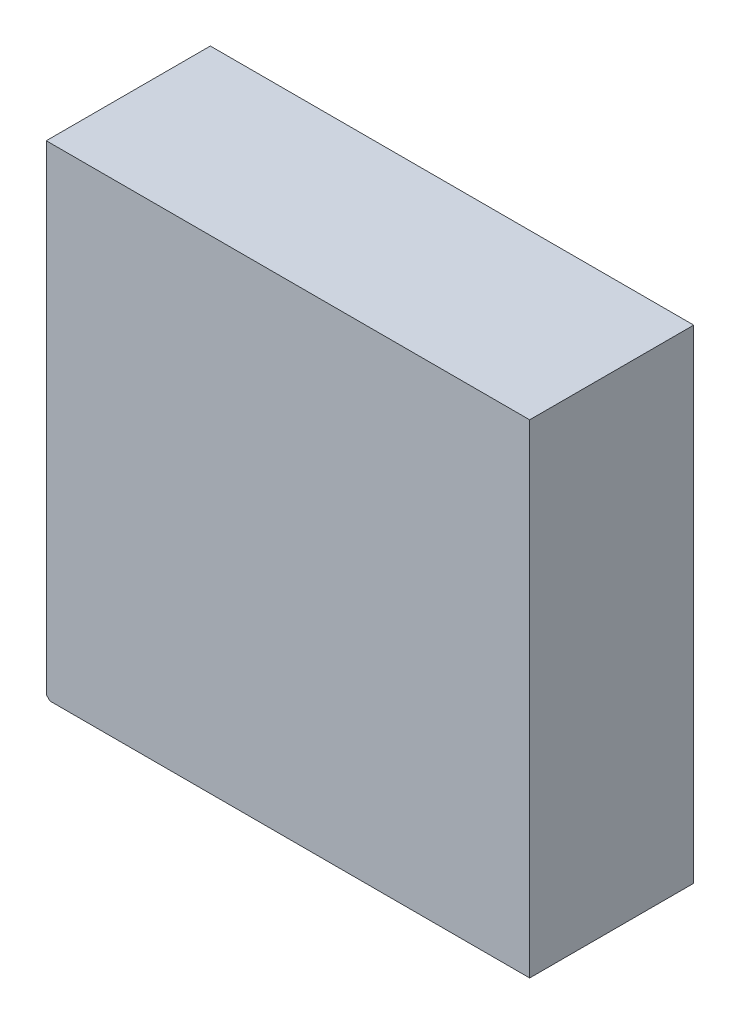
ISO-10303-21;
HEADER;
FILE_DESCRIPTION(('STEP AP214'),'2;1');
FILE_NAME('part.step','',(''),(''),'','','');
FILE_SCHEMA(('AUTOMOTIVE_DESIGN { 1 0 10303 214 1 1 1 1 }'));
ENDSEC;
DATA;
#1=APPLICATION_CONTEXT('core data for automotive mechanical design processes');
#2=APPLICATION_PROTOCOL_DEFINITION('international standard','automotive_design',2000,#1);
#3=PRODUCT_CONTEXT('',#1,'mechanical');
#4=PRODUCT('Part','Part','',(#3));
#5=PRODUCT_RELATED_PRODUCT_CATEGORY('part','',(#4));
#6=PRODUCT_DEFINITION_FORMATION('','',#4);
#7=PRODUCT_DEFINITION_CONTEXT('part definition',#1,'design');
#8=PRODUCT_DEFINITION('design','',#6,#7);
#9=PRODUCT_DEFINITION_SHAPE('','',#8);
#10=(LENGTH_UNIT() NAMED_UNIT(*) SI_UNIT(.MILLI.,.METRE.));
#11=(NAMED_UNIT(*) PLANE_ANGLE_UNIT() SI_UNIT($,.RADIAN.));
#12=(NAMED_UNIT(*) SI_UNIT($,.STERADIAN.) SOLID_ANGLE_UNIT());
#13=UNCERTAINTY_MEASURE_WITH_UNIT(LENGTH_MEASURE(1.E-05),#10,'distance_accuracy_value','');
#14=(GEOMETRIC_REPRESENTATION_CONTEXT(3) GLOBAL_UNCERTAINTY_ASSIGNED_CONTEXT((#13)) GLOBAL_UNIT_ASSIGNED_CONTEXT((#10,
#11,#12)) REPRESENTATION_CONTEXT('',''));
#15=CARTESIAN_POINT('',(0.,0.,0.));
#16=DIRECTION('',(0.,0.,1.));
#17=DIRECTION('',(1.,0.,0.));
#18=AXIS2_PLACEMENT_3D('',#15,#16,#17);
#19=CARTESIAN_POINT('',(1.64999924,-1.64999924,1.1200003));
#20=DIRECTION('',(0.,0.,-1.));
#21=DIRECTION('',(-1.,0.,0.));
#22=AXIS2_PLACEMENT_3D('',#19,#20,#21);
#23=PLANE('',#22);
#24=DIRECTION('',(1.,0.,0.));
#25=VECTOR('',#24,1.);
#26=CARTESIAN_POINT('',(1.64999924,1.64999924,1.1200003));
#27=LINE('',#26,#25);
#28=CARTESIAN_POINT('',(1.64999924,1.64999924,1.1200003));
#29=VERTEX_POINT('',#28);
#30=CARTESIAN_POINT('',(-1.64999924,1.64999924,1.1200003));
#31=VERTEX_POINT('',#30);
#32=EDGE_CURVE('E86',#29,#31,#27,.F.);
#33=ORIENTED_EDGE('',*,*,#32,.T.);
#34=DIRECTION('',(0.,1.,0.));
#35=VECTOR('',#34,1.);
#36=CARTESIAN_POINT('',(-1.64999924,1.64999924,1.1200003));
#37=LINE('',#36,#35);
#38=CARTESIAN_POINT('',(-1.64999924,-1.62500056,1.1200003));
#39=VERTEX_POINT('',#38);
#40=EDGE_CURVE('E62',#31,#39,#37,.F.);
#41=ORIENTED_EDGE('',*,*,#40,.T.);
#42=DIRECTION('',(-0.707106781186548,0.707106781186548,0.));
#43=VECTOR('',#42,1.);
#44=CARTESIAN_POINT('',(-1.64999924,-1.62500056,1.1200003));
#45=LINE('',#44,#43);
#46=CARTESIAN_POINT('',(-1.62500056,-1.64999924,1.1200003));
#47=VERTEX_POINT('',#46);
#48=EDGE_CURVE('E64',#39,#47,#45,.F.);
#49=ORIENTED_EDGE('',*,*,#48,.T.);
#50=DIRECTION('',(1.,0.,0.));
#51=VECTOR('',#50,1.);
#52=CARTESIAN_POINT('',(-1.62500056,-1.64999924,1.1200003));
#53=LINE('',#52,#51);
#54=CARTESIAN_POINT('',(1.64999924,-1.64999924,1.1200003));
#55=VERTEX_POINT('',#54);
#56=EDGE_CURVE('E20',#47,#55,#53,.T.);
#57=ORIENTED_EDGE('',*,*,#56,.T.);
#58=DIRECTION('',(0.,1.,0.));
#59=VECTOR('',#58,1.);
#60=CARTESIAN_POINT('',(1.64999924,-1.64999924,1.1200003));
#61=LINE('',#60,#59);
#62=EDGE_CURVE('E91',#55,#29,#61,.T.);
#63=ORIENTED_EDGE('',*,*,#62,.T.);
#64=EDGE_LOOP('',(#33,#41,#49,#57,#63));
#65=FACE_BOUND('',#64,.T.);
#66=ADVANCED_FACE('F17',(#65),#23,.F.);
#67=CARTESIAN_POINT('',(-1.62500056,-1.64999924,0.));
#68=DIRECTION('',(0.,1.,0.));
#69=DIRECTION('',(0.,0.,1.));
#70=AXIS2_PLACEMENT_3D('',#67,#68,#69);
#71=PLANE('',#70);
#72=DIRECTION('',(0.,0.,1.));
#73=VECTOR('',#72,1.);
#74=CARTESIAN_POINT('',(1.64999924,-1.64999924,0.));
#75=LINE('',#74,#73);
#76=CARTESIAN_POINT('',(1.64999924,-1.64999924,0.));
#77=VERTEX_POINT('',#76);
#78=EDGE_CURVE('E75',#77,#55,#75,.T.);
#79=ORIENTED_EDGE('',*,*,#78,.T.);
#80=ORIENTED_EDGE('',*,*,#56,.F.);
#81=DIRECTION('',(0.,0.,1.));
#82=VECTOR('',#81,1.);
#83=CARTESIAN_POINT('',(-1.62500056,-1.64999924,0.));
#84=LINE('',#83,#82);
#85=CARTESIAN_POINT('',(-1.62500056,-1.64999924,0.));
#86=VERTEX_POINT('',#85);
#87=EDGE_CURVE('E70',#47,#86,#84,.F.);
#88=ORIENTED_EDGE('',*,*,#87,.T.);
#89=DIRECTION('',(-1.,0.,0.));
#90=VECTOR('',#89,1.);
#91=CARTESIAN_POINT('',(1.64999924,-1.64999924,0.));
#92=LINE('',#91,#90);
#93=EDGE_CURVE('E94',#77,#86,#92,.T.);
#94=ORIENTED_EDGE('',*,*,#93,.F.);
#95=EDGE_LOOP('',(#79,#80,#88,#94));
#96=FACE_BOUND('',#95,.T.);
#97=ADVANCED_FACE('F72',(#96),#71,.F.);
#98=CARTESIAN_POINT('',(-1.64999924,-1.62500056,0.));
#99=DIRECTION('',(0.707106781186548,0.707106781186548,0.));
#100=DIRECTION('',(-0.707106781186548,0.707106781186548,0.));
#101=AXIS2_PLACEMENT_3D('',#98,#99,#100);
#102=PLANE('',#101);
#103=ORIENTED_EDGE('',*,*,#87,.F.);
#104=ORIENTED_EDGE('',*,*,#48,.F.);
#105=DIRECTION('',(0.,0.,-1.));
#106=VECTOR('',#105,1.);
#107=CARTESIAN_POINT('',(-1.64999924,-1.62500056,0.));
#108=LINE('',#107,#106);
#109=CARTESIAN_POINT('',(-1.64999924,-1.62500056,0.));
#110=VERTEX_POINT('',#109);
#111=EDGE_CURVE('E82',#39,#110,#108,.T.);
#112=ORIENTED_EDGE('',*,*,#111,.T.);
#113=DIRECTION('',(-0.707106781186547,0.707106781186547,0.));
#114=VECTOR('',#113,1.);
#115=CARTESIAN_POINT('',(-1.62500056,-1.64999924,0.));
#116=LINE('',#115,#114);
#117=EDGE_CURVE('E79',#86,#110,#116,.T.);
#118=ORIENTED_EDGE('',*,*,#117,.F.);
#119=EDGE_LOOP('',(#103,#104,#112,#118));
#120=FACE_BOUND('',#119,.T.);
#121=ADVANCED_FACE('F77',(#120),#102,.F.);
#122=CARTESIAN_POINT('',(-1.64999924,1.64999924,0.));
#123=DIRECTION('',(1.,0.,0.));
#124=DIRECTION('',(0.,0.,-1.));
#125=AXIS2_PLACEMENT_3D('',#122,#123,#124);
#126=PLANE('',#125);
#127=ORIENTED_EDGE('',*,*,#111,.F.);
#128=ORIENTED_EDGE('',*,*,#40,.F.);
#129=DIRECTION('',(0.,0.,-1.));
#130=VECTOR('',#129,1.);
#131=CARTESIAN_POINT('',(-1.64999924,1.64999924,0.));
#132=LINE('',#131,#130);
#133=CARTESIAN_POINT('',(-1.64999924,1.64999924,0.));
#134=VERTEX_POINT('',#133);
#135=EDGE_CURVE('E88',#31,#134,#132,.T.);
#136=ORIENTED_EDGE('',*,*,#135,.T.);
#137=DIRECTION('',(0.,1.,0.));
#138=VECTOR('',#137,1.);
#139=CARTESIAN_POINT('',(-1.64999924,-1.64999924,0.));
#140=LINE('',#139,#138);
#141=EDGE_CURVE('E97',#110,#134,#140,.T.);
#142=ORIENTED_EDGE('',*,*,#141,.F.);
#143=EDGE_LOOP('',(#127,#128,#136,#142));
#144=FACE_BOUND('',#143,.T.);
#145=ADVANCED_FACE('F107',(#144),#126,.F.);
#146=CARTESIAN_POINT('',(1.64999924,1.64999924,0.));
#147=DIRECTION('',(0.,-1.,0.));
#148=DIRECTION('',(0.,0.,-1.));
#149=AXIS2_PLACEMENT_3D('',#146,#147,#148);
#150=PLANE('',#149);
#151=ORIENTED_EDGE('',*,*,#135,.F.);
#152=ORIENTED_EDGE('',*,*,#32,.F.);
#153=DIRECTION('',(0.,0.,1.));
#154=VECTOR('',#153,1.);
#155=CARTESIAN_POINT('',(1.64999924,1.64999924,0.));
#156=LINE('',#155,#154);
#157=CARTESIAN_POINT('',(1.64999924,1.64999924,0.));
#158=VERTEX_POINT('',#157);
#159=EDGE_CURVE('E35',#29,#158,#156,.F.);
#160=ORIENTED_EDGE('',*,*,#159,.T.);
#161=DIRECTION('',(-1.,0.,0.));
#162=VECTOR('',#161,1.);
#163=CARTESIAN_POINT('',(1.64999924,1.64999924,0.));
#164=LINE('',#163,#162);
#165=EDGE_CURVE('E26',#134,#158,#164,.F.);
#166=ORIENTED_EDGE('',*,*,#165,.F.);
#167=EDGE_LOOP('',(#151,#152,#160,#166));
#168=FACE_BOUND('',#167,.T.);
#169=ADVANCED_FACE('F105',(#168),#150,.F.);
#170=CARTESIAN_POINT('',(1.64999924,-1.64999924,0.));
#171=DIRECTION('',(-1.,0.,0.));
#172=DIRECTION('',(0.,0.,1.));
#173=AXIS2_PLACEMENT_3D('',#170,#171,#172);
#174=PLANE('',#173);
#175=ORIENTED_EDGE('',*,*,#159,.F.);
#176=ORIENTED_EDGE('',*,*,#62,.F.);
#177=ORIENTED_EDGE('',*,*,#78,.F.);
#178=DIRECTION('',(0.,1.,0.));
#179=VECTOR('',#178,1.);
#180=CARTESIAN_POINT('',(1.64999924,-1.64999924,0.));
#181=LINE('',#180,#179);
#182=EDGE_CURVE('E11',#158,#77,#181,.F.);
#183=ORIENTED_EDGE('',*,*,#182,.F.);
#184=EDGE_LOOP('',(#175,#176,#177,#183));
#185=FACE_BOUND('',#184,.T.);
#186=ADVANCED_FACE('F109',(#185),#174,.F.);
#187=CARTESIAN_POINT('',(1.64999924,-1.64999924,0.));
#188=DIRECTION('',(0.,0.,-1.));
#189=DIRECTION('',(-1.,0.,0.));
#190=AXIS2_PLACEMENT_3D('',#187,#188,#189);
#191=PLANE('',#190);
#192=ORIENTED_EDGE('',*,*,#165,.T.);
#193=ORIENTED_EDGE('',*,*,#182,.T.);
#194=ORIENTED_EDGE('',*,*,#93,.T.);
#195=ORIENTED_EDGE('',*,*,#117,.T.);
#196=ORIENTED_EDGE('',*,*,#141,.T.);
#197=EDGE_LOOP('',(#192,#193,#194,#195,#196));
#198=FACE_BOUND('',#197,.T.);
#199=ADVANCED_FACE('F102',(#198),#191,.T.);
#200=CLOSED_SHELL('',(#66,#97,#121,#145,#169,#186,#199));
#201=MANIFOLD_SOLID_BREP('B1',#200);
#202=ADVANCED_BREP_SHAPE_REPRESENTATION('',(#18,#201),#14);
#203=SHAPE_DEFINITION_REPRESENTATION(#9,#202);
ENDSEC;
END-ISO-10303-21;
